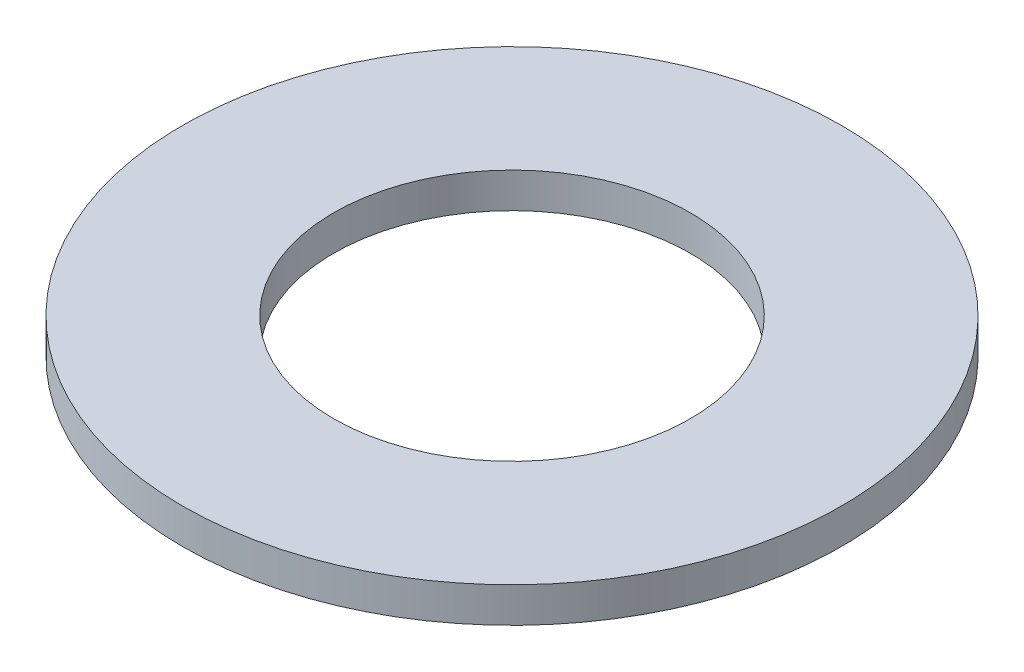
ISO-10303-21;
HEADER;
FILE_DESCRIPTION(('STEP AP214'),'2;1');
FILE_NAME('part.step','',(''),(''),'','','');
FILE_SCHEMA(('AUTOMOTIVE_DESIGN { 1 0 10303 214 1 1 1 1 }'));
ENDSEC;
DATA;
#1=APPLICATION_CONTEXT('core data for automotive mechanical design processes');
#2=APPLICATION_PROTOCOL_DEFINITION('international standard','automotive_design',2000,#1);
#3=PRODUCT_CONTEXT('',#1,'mechanical');
#4=PRODUCT('Part','Part','',(#3));
#5=PRODUCT_RELATED_PRODUCT_CATEGORY('part','',(#4));
#6=PRODUCT_DEFINITION_FORMATION('','',#4);
#7=PRODUCT_DEFINITION_CONTEXT('part definition',#1,'design');
#8=PRODUCT_DEFINITION('design','',#6,#7);
#9=PRODUCT_DEFINITION_SHAPE('','',#8);
#10=(LENGTH_UNIT() NAMED_UNIT(*) SI_UNIT(.MILLI.,.METRE.));
#11=(NAMED_UNIT(*) PLANE_ANGLE_UNIT() SI_UNIT($,.RADIAN.));
#12=(NAMED_UNIT(*) SI_UNIT($,.STERADIAN.) SOLID_ANGLE_UNIT());
#13=UNCERTAINTY_MEASURE_WITH_UNIT(LENGTH_MEASURE(1.E-05),#10,'distance_accuracy_value','');
#14=(GEOMETRIC_REPRESENTATION_CONTEXT(3) GLOBAL_UNCERTAINTY_ASSIGNED_CONTEXT((#13)) GLOBAL_UNIT_ASSIGNED_CONTEXT((#10,
#11,#12)) REPRESENTATION_CONTEXT('',''));
#15=CARTESIAN_POINT('',(0.,0.,0.));
#16=DIRECTION('',(0.,0.,1.));
#17=DIRECTION('',(1.,0.,0.));
#18=AXIS2_PLACEMENT_3D('',#15,#16,#17);
#19=CARTESIAN_POINT('',(0.,1.016,0.));
#20=DIRECTION('',(0.,-1.,0.));
#21=DIRECTION('',(0.,0.,-1.));
#22=AXIS2_PLACEMENT_3D('',#19,#20,#21);
#23=CYLINDRICAL_SURFACE('',#22,9.525);
#24=CARTESIAN_POINT('',(0.,1.016,0.));
#25=DIRECTION('',(0.,1.,0.));
#26=DIRECTION('',(0.,0.,1.));
#27=AXIS2_PLACEMENT_3D('',#24,#25,#26);
#28=CIRCLE('',#27,9.525);
#29=CARTESIAN_POINT('',(0.,1.016,9.525));
#30=VERTEX_POINT('',#29);
#31=EDGE_CURVE('E10',#30,#30,#28,.T.);
#32=ORIENTED_EDGE('',*,*,#31,.F.);
#33=EDGE_LOOP('',(#32));
#34=FACE_BOUND('',#33,.T.);
#35=CARTESIAN_POINT('',(0.,0.,0.));
#36=DIRECTION('',(0.,1.,0.));
#37=DIRECTION('',(0.,0.,1.));
#38=AXIS2_PLACEMENT_3D('',#35,#36,#37);
#39=CIRCLE('',#38,9.525);
#40=CARTESIAN_POINT('',(0.,0.,9.525));
#41=VERTEX_POINT('',#40);
#42=EDGE_CURVE('E35',#41,#41,#39,.T.);
#43=ORIENTED_EDGE('',*,*,#42,.T.);
#44=EDGE_LOOP('',(#43));
#45=FACE_BOUND('',#44,.T.);
#46=ADVANCED_FACE('F32',(#34,#45),#23,.T.);
#47=CARTESIAN_POINT('',(0.,1.016,0.));
#48=DIRECTION('',(0.,1.,0.));
#49=DIRECTION('',(0.,0.,1.));
#50=AXIS2_PLACEMENT_3D('',#47,#48,#49);
#51=PLANE('',#50);
#52=CARTESIAN_POINT('',(0.,1.016,0.));
#53=DIRECTION('',(0.,1.,0.));
#54=DIRECTION('',(0.,0.,1.));
#55=AXIS2_PLACEMENT_3D('',#52,#53,#54);
#56=CIRCLE('',#55,5.1562);
#57=CARTESIAN_POINT('',(0.,1.016,5.1562));
#58=VERTEX_POINT('',#57);
#59=EDGE_CURVE('E44',#58,#58,#56,.T.);
#60=ORIENTED_EDGE('',*,*,#59,.F.);
#61=EDGE_LOOP('',(#60));
#62=FACE_BOUND('',#61,.T.);
#63=ORIENTED_EDGE('',*,*,#31,.T.);
#64=EDGE_LOOP('',(#63));
#65=FACE_BOUND('',#64,.T.);
#66=ADVANCED_FACE('F59',(#62,#65),#51,.T.);
#67=CARTESIAN_POINT('',(0.,0.,0.));
#68=DIRECTION('',(0.,1.,0.));
#69=DIRECTION('',(0.,0.,1.));
#70=AXIS2_PLACEMENT_3D('',#67,#68,#69);
#71=PLANE('',#70);
#72=CARTESIAN_POINT('',(0.,0.,0.));
#73=DIRECTION('',(0.,1.,0.));
#74=DIRECTION('',(0.,0.,1.));
#75=AXIS2_PLACEMENT_3D('',#72,#73,#74);
#76=CIRCLE('',#75,5.1562);
#77=CARTESIAN_POINT('',(0.,0.,5.1562));
#78=VERTEX_POINT('',#77);
#79=EDGE_CURVE('E42',#78,#78,#76,.T.);
#80=ORIENTED_EDGE('',*,*,#79,.T.);
#81=EDGE_LOOP('',(#80));
#82=FACE_BOUND('',#81,.T.);
#83=ORIENTED_EDGE('',*,*,#42,.F.);
#84=EDGE_LOOP('',(#83));
#85=FACE_BOUND('',#84,.T.);
#86=ADVANCED_FACE('F50',(#82,#85),#71,.F.);
#87=CARTESIAN_POINT('',(0.,0.,0.));
#88=DIRECTION('',(0.,1.,0.));
#89=DIRECTION('',(0.,0.,1.));
#90=AXIS2_PLACEMENT_3D('',#87,#88,#89);
#91=CYLINDRICAL_SURFACE('',#90,5.1562);
#92=ORIENTED_EDGE('',*,*,#79,.F.);
#93=EDGE_LOOP('',(#92));
#94=FACE_BOUND('',#93,.T.);
#95=ORIENTED_EDGE('',*,*,#59,.T.);
#96=EDGE_LOOP('',(#95));
#97=FACE_BOUND('',#96,.T.);
#98=ADVANCED_FACE('F53',(#94,#97),#91,.F.);
#99=CLOSED_SHELL('',(#46,#66,#86,#98));
#100=MANIFOLD_SOLID_BREP('B2',#99);
#101=ADVANCED_BREP_SHAPE_REPRESENTATION('',(#18,#100),#14);
#102=SHAPE_DEFINITION_REPRESENTATION(#9,#101);
ENDSEC;
END-ISO-10303-21;
